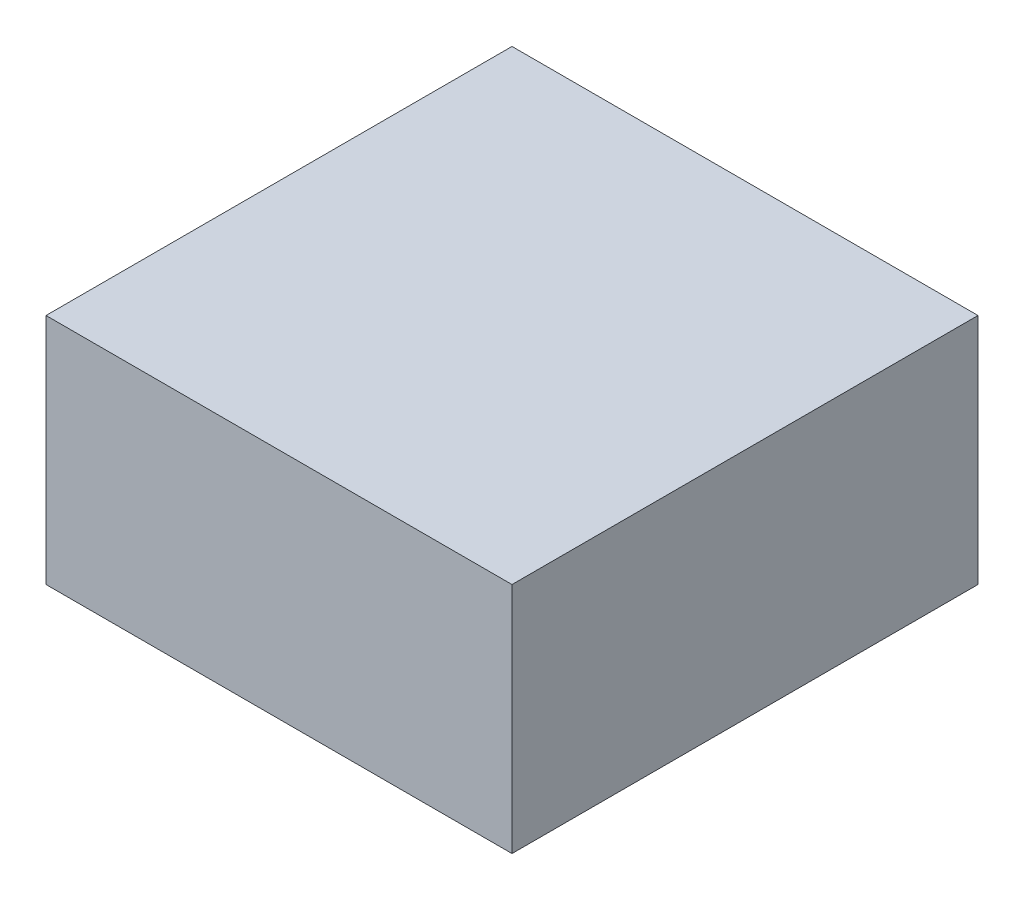
ISO-10303-21;
HEADER;
FILE_DESCRIPTION(('STEP AP214'),'2;1');
FILE_NAME('part.step','',(''),(''),'','','');
FILE_SCHEMA(('AUTOMOTIVE_DESIGN { 1 0 10303 214 1 1 1 1 }'));
ENDSEC;
DATA;
#1=APPLICATION_CONTEXT('core data for automotive mechanical design processes');
#2=APPLICATION_PROTOCOL_DEFINITION('international standard','automotive_design',2000,#1);
#3=PRODUCT_CONTEXT('',#1,'mechanical');
#4=PRODUCT('Part','Part','',(#3));
#5=PRODUCT_RELATED_PRODUCT_CATEGORY('part','',(#4));
#6=PRODUCT_DEFINITION_FORMATION('','',#4);
#7=PRODUCT_DEFINITION_CONTEXT('part definition',#1,'design');
#8=PRODUCT_DEFINITION('design','',#6,#7);
#9=PRODUCT_DEFINITION_SHAPE('','',#8);
#10=(LENGTH_UNIT() NAMED_UNIT(*) SI_UNIT(.MILLI.,.METRE.));
#11=(NAMED_UNIT(*) PLANE_ANGLE_UNIT() SI_UNIT($,.RADIAN.));
#12=(NAMED_UNIT(*) SI_UNIT($,.STERADIAN.) SOLID_ANGLE_UNIT());
#13=UNCERTAINTY_MEASURE_WITH_UNIT(LENGTH_MEASURE(1.E-05),#10,'distance_accuracy_value','');
#14=(GEOMETRIC_REPRESENTATION_CONTEXT(3) GLOBAL_UNCERTAINTY_ASSIGNED_CONTEXT((#13)) GLOBAL_UNIT_ASSIGNED_CONTEXT((#10,
#11,#12)) REPRESENTATION_CONTEXT('',''));
#15=CARTESIAN_POINT('',(0.,0.,0.));
#16=DIRECTION('',(0.,0.,1.));
#17=DIRECTION('',(1.,0.,0.));
#18=AXIS2_PLACEMENT_3D('',#15,#16,#17);
#19=CARTESIAN_POINT('',(20.,10.,40.));
#20=DIRECTION('',(-1.,0.,0.));
#21=DIRECTION('',(0.,0.,1.));
#22=AXIS2_PLACEMENT_3D('',#19,#20,#21);
#23=PLANE('',#22);
#24=DIRECTION('',(0.,1.,0.));
#25=VECTOR('',#24,1.);
#26=CARTESIAN_POINT('',(20.,10.,0.));
#27=LINE('',#26,#25);
#28=CARTESIAN_POINT('',(20.,-10.,0.));
#29=VERTEX_POINT('',#28);
#30=CARTESIAN_POINT('',(20.,10.,0.));
#31=VERTEX_POINT('',#30);
#32=EDGE_CURVE('E97',#29,#31,#27,.T.);
#33=ORIENTED_EDGE('',*,*,#32,.T.);
#34=DIRECTION('',(0.,0.,-1.));
#35=VECTOR('',#34,1.);
#36=CARTESIAN_POINT('',(20.,10.,40.));
#37=LINE('',#36,#35);
#38=CARTESIAN_POINT('',(20.,10.,40.));
#39=VERTEX_POINT('',#38);
#40=EDGE_CURVE('E11',#39,#31,#37,.T.);
#41=ORIENTED_EDGE('',*,*,#40,.F.);
#42=DIRECTION('',(0.,1.,0.));
#43=VECTOR('',#42,1.);
#44=CARTESIAN_POINT('',(20.,10.,40.));
#45=LINE('',#44,#43);
#46=CARTESIAN_POINT('',(20.,-10.,40.));
#47=VERTEX_POINT('',#46);
#48=EDGE_CURVE('E85',#47,#39,#45,.T.);
#49=ORIENTED_EDGE('',*,*,#48,.F.);
#50=DIRECTION('',(0.,0.,-1.));
#51=VECTOR('',#50,1.);
#52=CARTESIAN_POINT('',(20.,-10.,40.));
#53=LINE('',#52,#51);
#54=EDGE_CURVE('E93',#47,#29,#53,.T.);
#55=ORIENTED_EDGE('',*,*,#54,.T.);
#56=EDGE_LOOP('',(#33,#41,#49,#55));
#57=FACE_BOUND('',#56,.T.);
#58=ADVANCED_FACE('F34',(#57),#23,.F.);
#59=CARTESIAN_POINT('',(-20.,10.,40.));
#60=DIRECTION('',(0.,-1.,0.));
#61=DIRECTION('',(0.,0.,-1.));
#62=AXIS2_PLACEMENT_3D('',#59,#60,#61);
#63=PLANE('',#62);
#64=DIRECTION('',(-1.,0.,0.));
#65=VECTOR('',#64,1.);
#66=CARTESIAN_POINT('',(-20.,10.,0.));
#67=LINE('',#66,#65);
#68=CARTESIAN_POINT('',(-20.,10.,0.));
#69=VERTEX_POINT('',#68);
#70=EDGE_CURVE('E89',#31,#69,#67,.T.);
#71=ORIENTED_EDGE('',*,*,#70,.T.);
#72=DIRECTION('',(0.,0.,-1.));
#73=VECTOR('',#72,1.);
#74=CARTESIAN_POINT('',(-20.,10.,40.));
#75=LINE('',#74,#73);
#76=CARTESIAN_POINT('',(-20.,10.,40.));
#77=VERTEX_POINT('',#76);
#78=EDGE_CURVE('E42',#77,#69,#75,.T.);
#79=ORIENTED_EDGE('',*,*,#78,.F.);
#80=DIRECTION('',(-1.,0.,0.));
#81=VECTOR('',#80,1.);
#82=CARTESIAN_POINT('',(-20.,10.,40.));
#83=LINE('',#82,#81);
#84=EDGE_CURVE('E80',#39,#77,#83,.T.);
#85=ORIENTED_EDGE('',*,*,#84,.F.);
#86=ORIENTED_EDGE('',*,*,#40,.T.);
#87=EDGE_LOOP('',(#71,#79,#85,#86));
#88=FACE_BOUND('',#87,.T.);
#89=ADVANCED_FACE('F88',(#88),#63,.F.);
#90=CARTESIAN_POINT('',(-20.,10.,40.));
#91=DIRECTION('',(1.,0.,0.));
#92=DIRECTION('',(0.,1.,0.));
#93=AXIS2_PLACEMENT_3D('',#90,#91,#92);
#94=PLANE('',#93);
#95=DIRECTION('',(0.,-1.,0.));
#96=VECTOR('',#95,1.);
#97=CARTESIAN_POINT('',(-20.,10.,0.));
#98=LINE('',#97,#96);
#99=CARTESIAN_POINT('',(-20.,-10.,0.));
#100=VERTEX_POINT('',#99);
#101=EDGE_CURVE('E67',#69,#100,#98,.T.);
#102=ORIENTED_EDGE('',*,*,#101,.T.);
#103=DIRECTION('',(0.,0.,-1.));
#104=VECTOR('',#103,1.);
#105=CARTESIAN_POINT('',(-20.,-10.,40.));
#106=LINE('',#105,#104);
#107=CARTESIAN_POINT('',(-20.,-10.,40.));
#108=VERTEX_POINT('',#107);
#109=EDGE_CURVE('E90',#108,#100,#106,.T.);
#110=ORIENTED_EDGE('',*,*,#109,.F.);
#111=DIRECTION('',(0.,-1.,0.));
#112=VECTOR('',#111,1.);
#113=CARTESIAN_POINT('',(-20.,10.,40.));
#114=LINE('',#113,#112);
#115=EDGE_CURVE('E83',#77,#108,#114,.T.);
#116=ORIENTED_EDGE('',*,*,#115,.F.);
#117=ORIENTED_EDGE('',*,*,#78,.T.);
#118=EDGE_LOOP('',(#102,#110,#116,#117));
#119=FACE_BOUND('',#118,.T.);
#120=ADVANCED_FACE('F91',(#119),#94,.F.);
#121=CARTESIAN_POINT('',(-20.,-10.,40.));
#122=DIRECTION('',(0.,1.,0.));
#123=DIRECTION('',(0.,0.,1.));
#124=AXIS2_PLACEMENT_3D('',#121,#122,#123);
#125=PLANE('',#124);
#126=DIRECTION('',(1.,0.,0.));
#127=VECTOR('',#126,1.);
#128=CARTESIAN_POINT('',(-20.,-10.,0.));
#129=LINE('',#128,#127);
#130=EDGE_CURVE('E73',#100,#29,#129,.T.);
#131=ORIENTED_EDGE('',*,*,#130,.T.);
#132=ORIENTED_EDGE('',*,*,#54,.F.);
#133=DIRECTION('',(1.,0.,0.));
#134=VECTOR('',#133,1.);
#135=CARTESIAN_POINT('',(-20.,-10.,40.));
#136=LINE('',#135,#134);
#137=EDGE_CURVE('E50',#108,#47,#136,.T.);
#138=ORIENTED_EDGE('',*,*,#137,.F.);
#139=ORIENTED_EDGE('',*,*,#109,.T.);
#140=EDGE_LOOP('',(#131,#132,#138,#139));
#141=FACE_BOUND('',#140,.T.);
#142=ADVANCED_FACE('F104',(#141),#125,.F.);
#143=CARTESIAN_POINT('',(0.,0.,40.));
#144=DIRECTION('',(0.,0.,1.));
#145=DIRECTION('',(1.,0.,0.));
#146=AXIS2_PLACEMENT_3D('',#143,#144,#145);
#147=PLANE('',#146);
#148=ORIENTED_EDGE('',*,*,#48,.T.);
#149=ORIENTED_EDGE('',*,*,#84,.T.);
#150=ORIENTED_EDGE('',*,*,#115,.T.);
#151=ORIENTED_EDGE('',*,*,#137,.T.);
#152=EDGE_LOOP('',(#148,#149,#150,#151));
#153=FACE_BOUND('',#152,.T.);
#154=ADVANCED_FACE('F81',(#153),#147,.T.);
#155=CARTESIAN_POINT('',(0.,0.,0.));
#156=DIRECTION('',(0.,0.,1.));
#157=DIRECTION('',(1.,0.,0.));
#158=AXIS2_PLACEMENT_3D('',#155,#156,#157);
#159=PLANE('',#158);
#160=ORIENTED_EDGE('',*,*,#32,.F.);
#161=ORIENTED_EDGE('',*,*,#130,.F.);
#162=ORIENTED_EDGE('',*,*,#101,.F.);
#163=ORIENTED_EDGE('',*,*,#70,.F.);
#164=EDGE_LOOP('',(#160,#161,#162,#163));
#165=FACE_BOUND('',#164,.T.);
#166=ADVANCED_FACE('F107',(#165),#159,.F.);
#167=CLOSED_SHELL('',(#58,#89,#120,#142,#154,#166));
#168=MANIFOLD_SOLID_BREP('B2',#167);
#169=ADVANCED_BREP_SHAPE_REPRESENTATION('',(#18,#168),#14);
#170=SHAPE_DEFINITION_REPRESENTATION(#9,#169);
ENDSEC;
END-ISO-10303-21;
